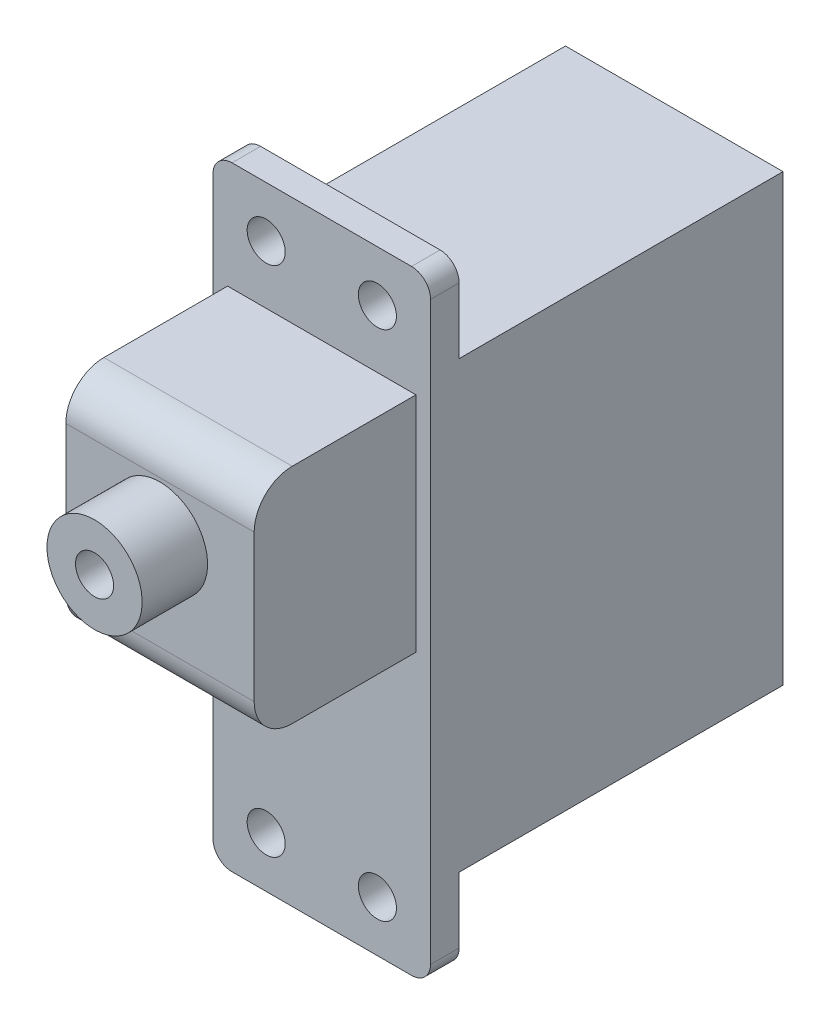
ISO-10303-21;
HEADER;
FILE_DESCRIPTION(('STEP AP214'),'2;1');
FILE_NAME('part.step','',(''),(''),'','','');
FILE_SCHEMA(('AUTOMOTIVE_DESIGN { 1 0 10303 214 1 1 1 1 }'));
ENDSEC;
DATA;
#1=APPLICATION_CONTEXT('core data for automotive mechanical design processes');
#2=APPLICATION_PROTOCOL_DEFINITION('international standard','automotive_design',2000,#1);
#3=PRODUCT_CONTEXT('',#1,'mechanical');
#4=PRODUCT('Part','Part','',(#3));
#5=PRODUCT_RELATED_PRODUCT_CATEGORY('part','',(#4));
#6=PRODUCT_DEFINITION_FORMATION('','',#4);
#7=PRODUCT_DEFINITION_CONTEXT('part definition',#1,'design');
#8=PRODUCT_DEFINITION('design','',#6,#7);
#9=PRODUCT_DEFINITION_SHAPE('','',#8);
#10=(LENGTH_UNIT() NAMED_UNIT(*) SI_UNIT(.MILLI.,.METRE.));
#11=(NAMED_UNIT(*) PLANE_ANGLE_UNIT() SI_UNIT($,.RADIAN.));
#12=(NAMED_UNIT(*) SI_UNIT($,.STERADIAN.) SOLID_ANGLE_UNIT());
#13=UNCERTAINTY_MEASURE_WITH_UNIT(LENGTH_MEASURE(1.E-05),#10,'distance_accuracy_value','');
#14=(GEOMETRIC_REPRESENTATION_CONTEXT(3) GLOBAL_UNCERTAINTY_ASSIGNED_CONTEXT((#13)) GLOBAL_UNIT_ASSIGNED_CONTEXT((#10,
#11,#12)) REPRESENTATION_CONTEXT('',''));
#15=CARTESIAN_POINT('',(0.,0.,0.));
#16=DIRECTION('',(0.,0.,1.));
#17=DIRECTION('',(1.,0.,0.));
#18=AXIS2_PLACEMENT_3D('',#15,#16,#17);
#19=CARTESIAN_POINT('',(0.,27.813,1.5));
#20=DIRECTION('',(0.,0.,1.));
#21=DIRECTION('',(1.,0.,0.));
#22=AXIS2_PLACEMENT_3D('',#19,#20,#21);
#23=PLANE('',#22);
#24=CARTESIAN_POINT('',(2.794,-1.778,1.5));
#25=DIRECTION('',(0.,0.,1.));
#26=DIRECTION('',(1.,0.,0.));
#27=AXIS2_PLACEMENT_3D('',#24,#25,#26);
#28=CIRCLE('',#27,0.999999999999986);
#29=CARTESIAN_POINT('',(3.79399999999999,-1.778,1.5));
#30=VERTEX_POINT('',#29);
#31=EDGE_CURVE('E334',#30,#30,#28,.T.);
#32=ORIENTED_EDGE('',*,*,#31,.F.);
#33=EDGE_LOOP('',(#32));
#34=FACE_BOUND('',#33,.T.);
#35=CARTESIAN_POINT('',(8.636,-1.778,1.5));
#36=DIRECTION('',(0.,0.,1.));
#37=DIRECTION('',(1.,0.,0.));
#38=AXIS2_PLACEMENT_3D('',#35,#36,#37);
#39=CIRCLE('',#38,0.999999999999986);
#40=CARTESIAN_POINT('',(9.63599999999999,-1.778,1.5));
#41=VERTEX_POINT('',#40);
#42=EDGE_CURVE('E328',#41,#41,#39,.T.);
#43=ORIENTED_EDGE('',*,*,#42,.F.);
#44=EDGE_LOOP('',(#43));
#45=FACE_BOUND('',#44,.T.);
#46=CARTESIAN_POINT('',(8.636,25.146,1.5));
#47=DIRECTION('',(0.,0.,1.));
#48=DIRECTION('',(1.,0.,0.));
#49=AXIS2_PLACEMENT_3D('',#46,#47,#48);
#50=CIRCLE('',#49,0.999999999999986);
#51=CARTESIAN_POINT('',(9.63599999999999,25.146,1.5));
#52=VERTEX_POINT('',#51);
#53=EDGE_CURVE('E322',#52,#52,#50,.T.);
#54=ORIENTED_EDGE('',*,*,#53,.F.);
#55=EDGE_LOOP('',(#54));
#56=FACE_BOUND('',#55,.T.);
#57=CARTESIAN_POINT('',(2.794,25.146,1.5));
#58=DIRECTION('',(0.,0.,1.));
#59=DIRECTION('',(1.,0.,0.));
#60=AXIS2_PLACEMENT_3D('',#57,#58,#59);
#61=CIRCLE('',#60,0.999999999999986);
#62=CARTESIAN_POINT('',(3.79399999999999,25.146,1.5));
#63=VERTEX_POINT('',#62);
#64=EDGE_CURVE('E316',#63,#63,#61,.T.);
#65=ORIENTED_EDGE('',*,*,#64,.F.);
#66=EDGE_LOOP('',(#65));
#67=FACE_BOUND('',#66,.T.);
#68=DIRECTION('',(1.,0.,0.));
#69=VECTOR('',#68,1.);
#70=CARTESIAN_POINT('',(0.,-4.445,1.5));
#71=LINE('',#70,#69);
#72=CARTESIAN_POINT('',(0.999999999999996,-4.445,1.5));
#73=VERTEX_POINT('',#72);
#74=CARTESIAN_POINT('',(10.43,-4.445,1.5));
#75=VERTEX_POINT('',#74);
#76=EDGE_CURVE('E233',#73,#75,#71,.T.);
#77=ORIENTED_EDGE('',*,*,#76,.T.);
#78=CARTESIAN_POINT('',(10.43,-3.445,1.5));
#79=DIRECTION('',(0.,0.,1.));
#80=DIRECTION('',(1.,0.,0.));
#81=AXIS2_PLACEMENT_3D('',#78,#79,#80);
#82=CIRCLE('',#81,1.);
#83=CARTESIAN_POINT('',(11.43,-3.445,1.5));
#84=VERTEX_POINT('',#83);
#85=EDGE_CURVE('E264',#75,#84,#82,.T.);
#86=ORIENTED_EDGE('',*,*,#85,.T.);
#87=DIRECTION('',(0.,-1.,0.));
#88=VECTOR('',#87,1.);
#89=CARTESIAN_POINT('',(11.43,27.813,1.5));
#90=LINE('',#89,#88);
#91=CARTESIAN_POINT('',(11.43,26.813,1.5));
#92=VERTEX_POINT('',#91);
#93=EDGE_CURVE('E220',#92,#84,#90,.T.);
#94=ORIENTED_EDGE('',*,*,#93,.F.);
#95=CARTESIAN_POINT('',(10.43,26.813,1.5));
#96=DIRECTION('',(0.,0.,1.));
#97=DIRECTION('',(1.,0.,0.));
#98=AXIS2_PLACEMENT_3D('',#95,#96,#97);
#99=CIRCLE('',#98,1.);
#100=CARTESIAN_POINT('',(10.43,27.813,1.5));
#101=VERTEX_POINT('',#100);
#102=EDGE_CURVE('E260',#92,#101,#99,.T.);
#103=ORIENTED_EDGE('',*,*,#102,.T.);
#104=DIRECTION('',(1.,0.,0.));
#105=VECTOR('',#104,1.);
#106=CARTESIAN_POINT('',(0.,27.813,1.5));
#107=LINE('',#106,#105);
#108=CARTESIAN_POINT('',(0.999999999999996,27.813,1.5));
#109=VERTEX_POINT('',#108);
#110=EDGE_CURVE('E238',#109,#101,#107,.T.);
#111=ORIENTED_EDGE('',*,*,#110,.F.);
#112=CARTESIAN_POINT('',(0.999999999999997,26.813,1.5));
#113=DIRECTION('',(0.,0.,1.));
#114=DIRECTION('',(1.,0.,0.));
#115=AXIS2_PLACEMENT_3D('',#112,#113,#114);
#116=CIRCLE('',#115,1.);
#117=CARTESIAN_POINT('',(0.,26.813,1.5));
#118=VERTEX_POINT('',#117);
#119=EDGE_CURVE('E262',#109,#118,#116,.T.);
#120=ORIENTED_EDGE('',*,*,#119,.T.);
#121=DIRECTION('',(0.,-1.,0.));
#122=VECTOR('',#121,1.);
#123=CARTESIAN_POINT('',(0.,27.813,1.5));
#124=LINE('',#123,#122);
#125=CARTESIAN_POINT('',(0.,-3.445,1.5));
#126=VERTEX_POINT('',#125);
#127=EDGE_CURVE('E226',#118,#126,#124,.T.);
#128=ORIENTED_EDGE('',*,*,#127,.T.);
#129=CARTESIAN_POINT('',(0.999999999999997,-3.445,1.5));
#130=DIRECTION('',(0.,0.,1.));
#131=DIRECTION('',(1.,0.,0.));
#132=AXIS2_PLACEMENT_3D('',#129,#130,#131);
#133=CIRCLE('',#132,1.);
#134=EDGE_CURVE('E258',#126,#73,#133,.T.);
#135=ORIENTED_EDGE('',*,*,#134,.T.);
#136=EDGE_LOOP('',(#77,#86,#94,#103,#111,#120,#128,#135));
#137=FACE_BOUND('',#136,.T.);
#138=DIRECTION('',(1.,0.,0.));
#139=VECTOR('',#138,1.);
#140=CARTESIAN_POINT('',(10.661861365,10.376691472,1.5));
#141=LINE('',#140,#139);
#142=CARTESIAN_POINT('',(0.768138635,10.376691472,1.5));
#143=VERTEX_POINT('',#142);
#144=CARTESIAN_POINT('',(10.661861365,10.376691472,1.5));
#145=VERTEX_POINT('',#144);
#146=EDGE_CURVE('E160',#143,#145,#141,.T.);
#147=ORIENTED_EDGE('',*,*,#146,.F.);
#148=DIRECTION('',(0.,-1.,0.));
#149=VECTOR('',#148,1.);
#150=CARTESIAN_POINT('',(0.768138635,10.376691472,1.5));
#151=LINE('',#150,#149);
#152=CARTESIAN_POINT('',(0.768138635,22.08777337,1.5));
#153=VERTEX_POINT('',#152);
#154=EDGE_CURVE('E167',#153,#143,#151,.T.);
#155=ORIENTED_EDGE('',*,*,#154,.F.);
#156=DIRECTION('',(-1.,0.,0.));
#157=VECTOR('',#156,1.);
#158=CARTESIAN_POINT('',(0.768138635,22.08777337,1.5));
#159=LINE('',#158,#157);
#160=CARTESIAN_POINT('',(10.661861365,22.08777337,1.5));
#161=VERTEX_POINT('',#160);
#162=EDGE_CURVE('E178',#161,#153,#159,.T.);
#163=ORIENTED_EDGE('',*,*,#162,.F.);
#164=DIRECTION('',(0.,1.,0.));
#165=VECTOR('',#164,1.);
#166=CARTESIAN_POINT('',(10.661861365,22.08777337,1.5));
#167=LINE('',#166,#165);
#168=EDGE_CURVE('E176',#145,#161,#167,.T.);
#169=ORIENTED_EDGE('',*,*,#168,.F.);
#170=EDGE_LOOP('',(#147,#155,#163,#169));
#171=FACE_BOUND('',#170,.T.);
#172=ADVANCED_FACE('F33',(#34,#45,#56,#67,#137,#171),#23,.T.);
#173=CARTESIAN_POINT('',(0.,27.813,-17.018));
#174=DIRECTION('',(0.,1.,0.));
#175=DIRECTION('',(0.,0.,1.));
#176=AXIS2_PLACEMENT_3D('',#173,#174,#175);
#177=PLANE('',#176);
#178=DIRECTION('',(-1.,0.,0.));
#179=VECTOR('',#178,1.);
#180=CARTESIAN_POINT('',(11.43,27.813,1.17600200411072E-09));
#181=LINE('',#180,#179);
#182=CARTESIAN_POINT('',(10.43,27.813,1.17600200411072E-09));
#183=VERTEX_POINT('',#182);
#184=CARTESIAN_POINT('',(0.999999999999997,27.813,1.17600200411072E-09));
#185=VERTEX_POINT('',#184);
#186=EDGE_CURVE('E201',#183,#185,#181,.T.);
#187=ORIENTED_EDGE('',*,*,#186,.T.);
#188=DIRECTION('',(0.,0.,1.));
#189=VECTOR('',#188,1.);
#190=CARTESIAN_POINT('',(0.999999999999997,27.813,1.5));
#191=LINE('',#190,#189);
#192=EDGE_CURVE('E268',#185,#109,#191,.T.);
#193=ORIENTED_EDGE('',*,*,#192,.T.);
#194=ORIENTED_EDGE('',*,*,#110,.T.);
#195=DIRECTION('',(0.,0.,1.));
#196=VECTOR('',#195,1.);
#197=CARTESIAN_POINT('',(10.43,27.813,-17.018));
#198=LINE('',#197,#196);
#199=EDGE_CURVE('E266',#101,#183,#198,.F.);
#200=ORIENTED_EDGE('',*,*,#199,.T.);
#201=EDGE_LOOP('',(#187,#193,#194,#200));
#202=FACE_BOUND('',#201,.T.);
#203=ADVANCED_FACE('F398',(#202),#177,.T.);
#204=CARTESIAN_POINT('',(0.,-4.445,-17.018));
#205=DIRECTION('',(0.,0.,-1.));
#206=DIRECTION('',(-1.,0.,0.));
#207=AXIS2_PLACEMENT_3D('',#204,#205,#206);
#208=PLANE('',#207);
#209=DIRECTION('',(-1.,0.,0.));
#210=VECTOR('',#209,1.);
#211=CARTESIAN_POINT('',(11.43,23.368000009754,-17.018));
#212=LINE('',#211,#210);
#213=CARTESIAN_POINT('',(11.43,23.368000009754,-17.018));
#214=VERTEX_POINT('',#213);
#215=CARTESIAN_POINT('',(0.,23.368000009754,-17.018));
#216=VERTEX_POINT('',#215);
#217=EDGE_CURVE('E196',#214,#216,#212,.T.);
#218=ORIENTED_EDGE('',*,*,#217,.F.);
#219=DIRECTION('',(0.,1.,0.));
#220=VECTOR('',#219,1.);
#221=CARTESIAN_POINT('',(11.43,-4.445,-17.018));
#222=LINE('',#221,#220);
#223=CARTESIAN_POINT('',(11.43,-9.7539988239137E-09,-17.018));
#224=VERTEX_POINT('',#223);
#225=EDGE_CURVE('E230',#224,#214,#222,.T.);
#226=ORIENTED_EDGE('',*,*,#225,.F.);
#227=DIRECTION('',(-1.,0.,0.));
#228=VECTOR('',#227,1.);
#229=CARTESIAN_POINT('',(11.43,-9.75399925759457E-09,-17.018));
#230=LINE('',#229,#228);
#231=CARTESIAN_POINT('',(0.,-9.75399925759457E-09,-17.018));
#232=VERTEX_POINT('',#231);
#233=EDGE_CURVE('E221',#224,#232,#230,.T.);
#234=ORIENTED_EDGE('',*,*,#233,.T.);
#235=DIRECTION('',(0.,1.,0.));
#236=VECTOR('',#235,1.);
#237=CARTESIAN_POINT('',(0.,-4.445,-17.018));
#238=LINE('',#237,#236);
#239=EDGE_CURVE('E229',#232,#216,#238,.T.);
#240=ORIENTED_EDGE('',*,*,#239,.T.);
#241=EDGE_LOOP('',(#218,#226,#234,#240));
#242=FACE_BOUND('',#241,.T.);
#243=ADVANCED_FACE('F382',(#242),#208,.T.);
#244=CARTESIAN_POINT('',(0.,-4.445,1.5));
#245=DIRECTION('',(0.,-1.,0.));
#246=DIRECTION('',(0.,0.,-1.));
#247=AXIS2_PLACEMENT_3D('',#244,#245,#246);
#248=PLANE('',#247);
#249=DIRECTION('',(-1.,0.,0.));
#250=VECTOR('',#249,1.);
#251=CARTESIAN_POINT('',(11.43,-4.445,1.1760037388342E-09));
#252=LINE('',#251,#250);
#253=CARTESIAN_POINT('',(10.43,-4.445,1.1760037388342E-09));
#254=VERTEX_POINT('',#253);
#255=CARTESIAN_POINT('',(0.999999999999997,-4.445,1.1760037388342E-09));
#256=VERTEX_POINT('',#255);
#257=EDGE_CURVE('E217',#254,#256,#252,.T.);
#258=ORIENTED_EDGE('',*,*,#257,.F.);
#259=DIRECTION('',(0.,0.,-1.));
#260=VECTOR('',#259,1.);
#261=CARTESIAN_POINT('',(10.43,-4.445,1.5));
#262=LINE('',#261,#260);
#263=EDGE_CURVE('E256',#254,#75,#262,.F.);
#264=ORIENTED_EDGE('',*,*,#263,.T.);
#265=ORIENTED_EDGE('',*,*,#76,.F.);
#266=DIRECTION('',(0.,0.,-1.));
#267=VECTOR('',#266,1.);
#268=CARTESIAN_POINT('',(0.999999999999997,-4.445,1.1760037388342E-09));
#269=LINE('',#268,#267);
#270=EDGE_CURVE('E253',#73,#256,#269,.T.);
#271=ORIENTED_EDGE('',*,*,#270,.T.);
#272=EDGE_LOOP('',(#258,#264,#265,#271));
#273=FACE_BOUND('',#272,.T.);
#274=ADVANCED_FACE('F365',(#273),#248,.T.);
#275=CARTESIAN_POINT('',(0.,-4.445,1.5));
#276=DIRECTION('',(1.,0.,0.));
#277=DIRECTION('',(0.,0.,-1.));
#278=AXIS2_PLACEMENT_3D('',#275,#276,#277);
#279=PLANE('',#278);
#280=ORIENTED_EDGE('',*,*,#127,.F.);
#281=DIRECTION('',(0.,0.,1.));
#282=VECTOR('',#281,1.);
#283=CARTESIAN_POINT('',(0.,26.813,1.17600026938725E-09));
#284=LINE('',#283,#282);
#285=CARTESIAN_POINT('',(0.,26.813,1.17600200411072E-09));
#286=VERTEX_POINT('',#285);
#287=EDGE_CURVE('E273',#118,#286,#284,.F.);
#288=ORIENTED_EDGE('',*,*,#287,.T.);
#289=DIRECTION('',(0.,1.,0.));
#290=VECTOR('',#289,1.);
#291=CARTESIAN_POINT('',(0.,23.368000009754,1.17600200411072E-09));
#292=LINE('',#291,#290);
#293=CARTESIAN_POINT('',(0.,23.368000009754,1.17600200411072E-09));
#294=VERTEX_POINT('',#293);
#295=EDGE_CURVE('E193',#294,#286,#292,.T.);
#296=ORIENTED_EDGE('',*,*,#295,.F.);
#297=DIRECTION('',(0.,0.,1.));
#298=VECTOR('',#297,1.);
#299=CARTESIAN_POINT('',(0.,23.368000009754,-17.018));
#300=LINE('',#299,#298);
#301=EDGE_CURVE('E163',#216,#294,#300,.T.);
#302=ORIENTED_EDGE('',*,*,#301,.F.);
#303=ORIENTED_EDGE('',*,*,#239,.F.);
#304=DIRECTION('',(0.,0.,-1.));
#305=VECTOR('',#304,1.);
#306=CARTESIAN_POINT('',(0.,-9.75399925759457E-09,1.17600200411072E-09));
#307=LINE('',#306,#305);
#308=CARTESIAN_POINT('',(0.,-9.75399925759457E-09,1.17600200411072E-09));
#309=VERTEX_POINT('',#308);
#310=EDGE_CURVE('E211',#309,#232,#307,.T.);
#311=ORIENTED_EDGE('',*,*,#310,.F.);
#312=DIRECTION('',(0.,1.,0.));
#313=VECTOR('',#312,1.);
#314=CARTESIAN_POINT('',(0.,-4.445,1.1760037388342E-09));
#315=LINE('',#314,#313);
#316=CARTESIAN_POINT('',(0.,-3.445,1.1760033485702E-09));
#317=VERTEX_POINT('',#316);
#318=EDGE_CURVE('E204',#317,#309,#315,.T.);
#319=ORIENTED_EDGE('',*,*,#318,.F.);
#320=DIRECTION('',(0.,0.,-1.));
#321=VECTOR('',#320,1.);
#322=CARTESIAN_POINT('',(0.,-3.445,1.5));
#323=LINE('',#322,#321);
#324=EDGE_CURVE('E271',#317,#126,#323,.F.);
#325=ORIENTED_EDGE('',*,*,#324,.T.);
#326=EDGE_LOOP('',(#280,#288,#296,#302,#303,#311,#319,#325));
#327=FACE_BOUND('',#326,.T.);
#328=ADVANCED_FACE('F376',(#327),#279,.F.);
#329=CARTESIAN_POINT('',(11.43,-4.445,1.5));
#330=DIRECTION('',(1.,0.,0.));
#331=DIRECTION('',(0.,0.,-1.));
#332=AXIS2_PLACEMENT_3D('',#329,#330,#331);
#333=PLANE('',#332);
#334=ORIENTED_EDGE('',*,*,#93,.T.);
#335=DIRECTION('',(0.,0.,-1.));
#336=VECTOR('',#335,1.);
#337=CARTESIAN_POINT('',(11.43,-3.445,1.5));
#338=LINE('',#337,#336);
#339=CARTESIAN_POINT('',(11.43,-3.445,1.1760033485702E-09));
#340=VERTEX_POINT('',#339);
#341=EDGE_CURVE('E246',#84,#340,#338,.T.);
#342=ORIENTED_EDGE('',*,*,#341,.T.);
#343=DIRECTION('',(0.,1.,0.));
#344=VECTOR('',#343,1.);
#345=CARTESIAN_POINT('',(11.43,-4.445,1.1760037388342E-09));
#346=LINE('',#345,#344);
#347=CARTESIAN_POINT('',(11.43,-9.75399925759457E-09,1.17600200411072E-09));
#348=VERTEX_POINT('',#347);
#349=EDGE_CURVE('E208',#340,#348,#346,.T.);
#350=ORIENTED_EDGE('',*,*,#349,.T.);
#351=DIRECTION('',(0.,0.,-1.));
#352=VECTOR('',#351,1.);
#353=CARTESIAN_POINT('',(11.43,-9.75399925759457E-09,1.17600200411072E-09));
#354=LINE('',#353,#352);
#355=EDGE_CURVE('E210',#348,#224,#354,.T.);
#356=ORIENTED_EDGE('',*,*,#355,.T.);
#357=ORIENTED_EDGE('',*,*,#225,.T.);
#358=DIRECTION('',(0.,0.,1.));
#359=VECTOR('',#358,1.);
#360=CARTESIAN_POINT('',(11.43,23.368000009754,-17.018));
#361=LINE('',#360,#359);
#362=CARTESIAN_POINT('',(11.43,23.368000009754,1.17600200411072E-09));
#363=VERTEX_POINT('',#362);
#364=EDGE_CURVE('E189',#214,#363,#361,.T.);
#365=ORIENTED_EDGE('',*,*,#364,.T.);
#366=DIRECTION('',(0.,1.,0.));
#367=VECTOR('',#366,1.);
#368=CARTESIAN_POINT('',(11.43,23.368000009754,1.17600200411072E-09));
#369=LINE('',#368,#367);
#370=CARTESIAN_POINT('',(11.43,26.813,1.17600200411072E-09));
#371=VERTEX_POINT('',#370);
#372=EDGE_CURVE('E192',#363,#371,#369,.T.);
#373=ORIENTED_EDGE('',*,*,#372,.T.);
#374=DIRECTION('',(0.,0.,1.));
#375=VECTOR('',#374,1.);
#376=CARTESIAN_POINT('',(11.43,26.813,1.50000000000001));
#377=LINE('',#376,#375);
#378=EDGE_CURVE('E241',#371,#92,#377,.T.);
#379=ORIENTED_EDGE('',*,*,#378,.T.);
#380=EDGE_LOOP('',(#334,#342,#350,#356,#357,#365,#373,#379));
#381=FACE_BOUND('',#380,.T.);
#382=ADVANCED_FACE('F347',(#381),#333,.T.);
#383=CARTESIAN_POINT('',(11.43,-4.445,1.1760037388342E-09));
#384=DIRECTION('',(0.,0.,1.));
#385=DIRECTION('',(0.,-1.,0.));
#386=AXIS2_PLACEMENT_3D('',#383,#384,#385);
#387=PLANE('',#386);
#388=CARTESIAN_POINT('',(2.794,-1.778,0.));
#389=DIRECTION('',(0.,0.,-1.));
#390=DIRECTION('',(0.,1.,0.));
#391=AXIS2_PLACEMENT_3D('',#388,#389,#390);
#392=CIRCLE('',#391,0.999999999999987);
#393=CARTESIAN_POINT('',(2.794,-0.778000000000013,0.));
#394=VERTEX_POINT('',#393);
#395=EDGE_CURVE('E337',#394,#394,#392,.T.);
#396=ORIENTED_EDGE('',*,*,#395,.F.);
#397=EDGE_LOOP('',(#396));
#398=FACE_BOUND('',#397,.T.);
#399=CARTESIAN_POINT('',(8.636,-1.778,0.));
#400=DIRECTION('',(0.,0.,-1.));
#401=DIRECTION('',(0.,1.,0.));
#402=AXIS2_PLACEMENT_3D('',#399,#400,#401);
#403=CIRCLE('',#402,0.999999999999987);
#404=CARTESIAN_POINT('',(8.636,-0.778000000000013,0.));
#405=VERTEX_POINT('',#404);
#406=EDGE_CURVE('E331',#405,#405,#403,.T.);
#407=ORIENTED_EDGE('',*,*,#406,.F.);
#408=EDGE_LOOP('',(#407));
#409=FACE_BOUND('',#408,.T.);
#410=ORIENTED_EDGE('',*,*,#349,.F.);
#411=CARTESIAN_POINT('',(10.43,-3.445,1.17600330515333E-09));
#412=DIRECTION('',(0.,0.,1.));
#413=DIRECTION('',(0.,-1.,0.));
#414=AXIS2_PLACEMENT_3D('',#411,#412,#413);
#415=CIRCLE('',#414,1.);
#416=EDGE_CURVE('E251',#340,#254,#415,.F.);
#417=ORIENTED_EDGE('',*,*,#416,.T.);
#418=ORIENTED_EDGE('',*,*,#257,.T.);
#419=CARTESIAN_POINT('',(0.999999999999997,-3.445,1.17600330515333E-09));
#420=DIRECTION('',(0.,0.,1.));
#421=DIRECTION('',(0.,-1.,0.));
#422=AXIS2_PLACEMENT_3D('',#419,#420,#421);
#423=CIRCLE('',#422,1.);
#424=EDGE_CURVE('E249',#256,#317,#423,.F.);
#425=ORIENTED_EDGE('',*,*,#424,.T.);
#426=ORIENTED_EDGE('',*,*,#318,.T.);
#427=DIRECTION('',(-1.,0.,0.));
#428=VECTOR('',#427,1.);
#429=CARTESIAN_POINT('',(11.43,-9.75399925759457E-09,1.17600200411072E-09));
#430=LINE('',#429,#428);
#431=EDGE_CURVE('E214',#348,#309,#430,.T.);
#432=ORIENTED_EDGE('',*,*,#431,.F.);
#433=EDGE_LOOP('',(#410,#417,#418,#425,#426,#432));
#434=FACE_BOUND('',#433,.T.);
#435=ADVANCED_FACE('F343',(#398,#409,#434),#387,.F.);
#436=CARTESIAN_POINT('',(11.43,-9.75399925759457E-09,1.17600200411072E-09));
#437=DIRECTION('',(0.,1.,0.));
#438=DIRECTION('',(0.,0.,1.));
#439=AXIS2_PLACEMENT_3D('',#436,#437,#438);
#440=PLANE('',#439);
#441=ORIENTED_EDGE('',*,*,#310,.T.);
#442=ORIENTED_EDGE('',*,*,#233,.F.);
#443=ORIENTED_EDGE('',*,*,#355,.F.);
#444=ORIENTED_EDGE('',*,*,#431,.T.);
#445=EDGE_LOOP('',(#441,#442,#443,#444));
#446=FACE_BOUND('',#445,.T.);
#447=ADVANCED_FACE('F346',(#446),#440,.F.);
#448=CARTESIAN_POINT('',(11.43,23.368000009754,1.17600200411072E-09));
#449=DIRECTION('',(0.,0.,1.));
#450=DIRECTION('',(1.,0.,0.));
#451=AXIS2_PLACEMENT_3D('',#448,#449,#450);
#452=PLANE('',#451);
#453=CARTESIAN_POINT('',(8.636,25.146,0.));
#454=DIRECTION('',(0.,0.,-1.));
#455=DIRECTION('',(0.,1.,0.));
#456=AXIS2_PLACEMENT_3D('',#453,#454,#455);
#457=CIRCLE('',#456,0.999999999999987);
#458=CARTESIAN_POINT('',(8.636,26.146,0.));
#459=VERTEX_POINT('',#458);
#460=EDGE_CURVE('E325',#459,#459,#457,.T.);
#461=ORIENTED_EDGE('',*,*,#460,.F.);
#462=EDGE_LOOP('',(#461));
#463=FACE_BOUND('',#462,.T.);
#464=CARTESIAN_POINT('',(2.794,25.146,0.));
#465=DIRECTION('',(0.,0.,-1.));
#466=DIRECTION('',(0.,1.,0.));
#467=AXIS2_PLACEMENT_3D('',#464,#465,#466);
#468=CIRCLE('',#467,0.999999999999987);
#469=CARTESIAN_POINT('',(2.794,26.146,0.));
#470=VERTEX_POINT('',#469);
#471=EDGE_CURVE('E319',#470,#470,#468,.T.);
#472=ORIENTED_EDGE('',*,*,#471,.F.);
#473=EDGE_LOOP('',(#472));
#474=FACE_BOUND('',#473,.T.);
#475=ORIENTED_EDGE('',*,*,#295,.T.);
#476=CARTESIAN_POINT('',(0.999999999999997,26.813,1.17600026938725E-09));
#477=DIRECTION('',(0.,0.,1.));
#478=DIRECTION('',(1.,0.,0.));
#479=AXIS2_PLACEMENT_3D('',#476,#477,#478);
#480=CIRCLE('',#479,1.);
#481=EDGE_CURVE('E277',#286,#185,#480,.F.);
#482=ORIENTED_EDGE('',*,*,#481,.T.);
#483=ORIENTED_EDGE('',*,*,#186,.F.);
#484=CARTESIAN_POINT('',(10.43,26.813,1.17600200411072E-09));
#485=DIRECTION('',(0.,0.,1.));
#486=DIRECTION('',(1.,0.,0.));
#487=AXIS2_PLACEMENT_3D('',#484,#485,#486);
#488=CIRCLE('',#487,1.);
#489=EDGE_CURVE('E275',#183,#371,#488,.F.);
#490=ORIENTED_EDGE('',*,*,#489,.T.);
#491=ORIENTED_EDGE('',*,*,#372,.F.);
#492=DIRECTION('',(-1.,0.,0.));
#493=VECTOR('',#492,1.);
#494=CARTESIAN_POINT('',(11.43,23.368000009754,1.17600200411072E-09));
#495=LINE('',#494,#493);
#496=EDGE_CURVE('E205',#363,#294,#495,.T.);
#497=ORIENTED_EDGE('',*,*,#496,.T.);
#498=EDGE_LOOP('',(#475,#482,#483,#490,#491,#497));
#499=FACE_BOUND('',#498,.T.);
#500=ADVANCED_FACE('F389',(#463,#474,#499),#452,.F.);
#501=CARTESIAN_POINT('',(11.43,23.368000009754,-17.018));
#502=DIRECTION('',(0.,-1.,0.));
#503=DIRECTION('',(0.,0.,-1.));
#504=AXIS2_PLACEMENT_3D('',#501,#502,#503);
#505=PLANE('',#504);
#506=ORIENTED_EDGE('',*,*,#301,.T.);
#507=ORIENTED_EDGE('',*,*,#496,.F.);
#508=ORIENTED_EDGE('',*,*,#364,.F.);
#509=ORIENTED_EDGE('',*,*,#217,.T.);
#510=EDGE_LOOP('',(#506,#507,#508,#509));
#511=FACE_BOUND('',#510,.T.);
#512=ADVANCED_FACE('F386',(#511),#505,.F.);
#513=CARTESIAN_POINT('',(0.768138635,10.376691472,10.));
#514=DIRECTION('',(1.,0.,0.));
#515=DIRECTION('',(0.,0.,-1.));
#516=AXIS2_PLACEMENT_3D('',#513,#514,#515);
#517=PLANE('',#516);
#518=DIRECTION('',(0.,0.,-1.));
#519=VECTOR('',#518,1.);
#520=CARTESIAN_POINT('',(0.768138635,10.376691472,10.));
#521=LINE('',#520,#519);
#522=CARTESIAN_POINT('',(0.768138635,10.376691472,8.));
#523=VERTEX_POINT('',#522);
#524=EDGE_CURVE('E156',#523,#143,#521,.T.);
#525=ORIENTED_EDGE('',*,*,#524,.F.);
#526=CARTESIAN_POINT('',(0.768138635,12.376691472,8.));
#527=DIRECTION('',(1.,0.,0.));
#528=DIRECTION('',(0.,0.,-1.));
#529=AXIS2_PLACEMENT_3D('',#526,#527,#528);
#530=CIRCLE('',#529,2.);
#531=CARTESIAN_POINT('',(0.768138635,12.376691472,10.));
#532=VERTEX_POINT('',#531);
#533=EDGE_CURVE('E41',#523,#532,#530,.F.);
#534=ORIENTED_EDGE('',*,*,#533,.T.);
#535=DIRECTION('',(0.,-1.,0.));
#536=VECTOR('',#535,1.);
#537=CARTESIAN_POINT('',(0.768138635,10.376691472,10.));
#538=LINE('',#537,#536);
#539=CARTESIAN_POINT('',(0.768138635,20.08777337,10.));
#540=VERTEX_POINT('',#539);
#541=EDGE_CURVE('E183',#540,#532,#538,.T.);
#542=ORIENTED_EDGE('',*,*,#541,.F.);
#543=CARTESIAN_POINT('',(0.768138635,20.08777337,8.));
#544=DIRECTION('',(1.,0.,0.));
#545=DIRECTION('',(0.,0.,-1.));
#546=AXIS2_PLACEMENT_3D('',#543,#544,#545);
#547=CIRCLE('',#546,2.);
#548=CARTESIAN_POINT('',(0.768138635,22.08777337,8.));
#549=VERTEX_POINT('',#548);
#550=EDGE_CURVE('E48',#540,#549,#547,.F.);
#551=ORIENTED_EDGE('',*,*,#550,.T.);
#552=DIRECTION('',(0.,0.,-1.));
#553=VECTOR('',#552,1.);
#554=CARTESIAN_POINT('',(0.768138635,22.08777337,10.));
#555=LINE('',#554,#553);
#556=EDGE_CURVE('E169',#549,#153,#555,.T.);
#557=ORIENTED_EDGE('',*,*,#556,.T.);
#558=ORIENTED_EDGE('',*,*,#154,.T.);
#559=EDGE_LOOP('',(#525,#534,#542,#551,#557,#558));
#560=FACE_BOUND('',#559,.T.);
#561=ADVANCED_FACE('F168',(#560),#517,.F.);
#562=CARTESIAN_POINT('',(10.661861365,10.376691472,10.));
#563=DIRECTION('',(0.,1.,0.));
#564=DIRECTION('',(-1.,0.,0.));
#565=AXIS2_PLACEMENT_3D('',#562,#563,#564);
#566=PLANE('',#565);
#567=DIRECTION('',(0.,0.,-1.));
#568=VECTOR('',#567,1.);
#569=CARTESIAN_POINT('',(10.661861365,10.376691472,10.));
#570=LINE('',#569,#568);
#571=CARTESIAN_POINT('',(10.661861365,10.376691472,8.));
#572=VERTEX_POINT('',#571);
#573=EDGE_CURVE('E164',#572,#145,#570,.T.);
#574=ORIENTED_EDGE('',*,*,#573,.F.);
#575=DIRECTION('',(1.,0.,0.));
#576=VECTOR('',#575,1.);
#577=CARTESIAN_POINT('',(10.661861365,10.376691472,8.));
#578=LINE('',#577,#576);
#579=EDGE_CURVE('E56',#572,#523,#578,.F.);
#580=ORIENTED_EDGE('',*,*,#579,.T.);
#581=ORIENTED_EDGE('',*,*,#524,.T.);
#582=ORIENTED_EDGE('',*,*,#146,.T.);
#583=EDGE_LOOP('',(#574,#580,#581,#582));
#584=FACE_BOUND('',#583,.T.);
#585=ADVANCED_FACE('F158',(#584),#566,.F.);
#586=CARTESIAN_POINT('',(10.661861365,22.08777337,10.));
#587=DIRECTION('',(-1.,0.,0.));
#588=DIRECTION('',(0.,0.,1.));
#589=AXIS2_PLACEMENT_3D('',#586,#587,#588);
#590=PLANE('',#589);
#591=DIRECTION('',(0.,1.,0.));
#592=VECTOR('',#591,1.);
#593=CARTESIAN_POINT('',(10.661861365,22.08777337,10.));
#594=LINE('',#593,#592);
#595=CARTESIAN_POINT('',(10.661861365,12.376691472,10.));
#596=VERTEX_POINT('',#595);
#597=CARTESIAN_POINT('',(10.661861365,20.08777337,10.));
#598=VERTEX_POINT('',#597);
#599=EDGE_CURVE('E186',#596,#598,#594,.T.);
#600=ORIENTED_EDGE('',*,*,#599,.F.);
#601=CARTESIAN_POINT('',(10.661861365,12.376691472,8.));
#602=DIRECTION('',(-1.,0.,0.));
#603=DIRECTION('',(0.,0.,1.));
#604=AXIS2_PLACEMENT_3D('',#601,#602,#603);
#605=CIRCLE('',#604,2.);
#606=EDGE_CURVE('E287',#596,#572,#605,.F.);
#607=ORIENTED_EDGE('',*,*,#606,.T.);
#608=ORIENTED_EDGE('',*,*,#573,.T.);
#609=ORIENTED_EDGE('',*,*,#168,.T.);
#610=DIRECTION('',(0.,0.,-1.));
#611=VECTOR('',#610,1.);
#612=CARTESIAN_POINT('',(10.661861365,22.08777337,10.));
#613=LINE('',#612,#611);
#614=CARTESIAN_POINT('',(10.661861365,22.08777337,8.));
#615=VERTEX_POINT('',#614);
#616=EDGE_CURVE('E185',#615,#161,#613,.T.);
#617=ORIENTED_EDGE('',*,*,#616,.F.);
#618=CARTESIAN_POINT('',(10.661861365,20.08777337,8.));
#619=DIRECTION('',(-1.,0.,0.));
#620=DIRECTION('',(0.,0.,1.));
#621=AXIS2_PLACEMENT_3D('',#618,#619,#620);
#622=CIRCLE('',#621,2.);
#623=EDGE_CURVE('E285',#615,#598,#622,.F.);
#624=ORIENTED_EDGE('',*,*,#623,.T.);
#625=EDGE_LOOP('',(#600,#607,#608,#609,#617,#624));
#626=FACE_BOUND('',#625,.T.);
#627=ADVANCED_FACE('F301',(#626),#590,.F.);
#628=CARTESIAN_POINT('',(0.768138635,22.08777337,10.));
#629=DIRECTION('',(0.,-1.,0.));
#630=DIRECTION('',(0.,0.,-1.));
#631=AXIS2_PLACEMENT_3D('',#628,#629,#630);
#632=PLANE('',#631);
#633=ORIENTED_EDGE('',*,*,#556,.F.);
#634=DIRECTION('',(-1.,0.,0.));
#635=VECTOR('',#634,1.);
#636=CARTESIAN_POINT('',(0.768138635,22.08777337,8.));
#637=LINE('',#636,#635);
#638=EDGE_CURVE('E11',#549,#615,#637,.F.);
#639=ORIENTED_EDGE('',*,*,#638,.T.);
#640=ORIENTED_EDGE('',*,*,#616,.T.);
#641=ORIENTED_EDGE('',*,*,#162,.T.);
#642=EDGE_LOOP('',(#633,#639,#640,#641));
#643=FACE_BOUND('',#642,.T.);
#644=ADVANCED_FACE('F442',(#643),#632,.F.);
#645=CARTESIAN_POINT('',(0.768138635,22.08777337,10.));
#646=DIRECTION('',(0.,0.,-1.));
#647=DIRECTION('',(-1.,0.,0.));
#648=AXIS2_PLACEMENT_3D('',#645,#646,#647);
#649=PLANE('',#648);
#650=CARTESIAN_POINT('',(5.715,17.399,10.));
#651=DIRECTION('',(0.,0.,-1.));
#652=DIRECTION('',(-1.,0.,0.));
#653=AXIS2_PLACEMENT_3D('',#650,#651,#652);
#654=CIRCLE('',#653,2.5);
#655=CARTESIAN_POINT('',(3.215,17.399,10.));
#656=VERTEX_POINT('',#655);
#657=EDGE_CURVE('E307',#656,#656,#654,.T.);
#658=ORIENTED_EDGE('',*,*,#657,.T.);
#659=EDGE_LOOP('',(#658));
#660=FACE_BOUND('',#659,.T.);
#661=ORIENTED_EDGE('',*,*,#541,.T.);
#662=DIRECTION('',(1.,0.,0.));
#663=VECTOR('',#662,1.);
#664=CARTESIAN_POINT('',(0.768138635000002,12.376691472,10.));
#665=LINE('',#664,#663);
#666=EDGE_CURVE('E282',#532,#596,#665,.T.);
#667=ORIENTED_EDGE('',*,*,#666,.T.);
#668=ORIENTED_EDGE('',*,*,#599,.T.);
#669=DIRECTION('',(-1.,0.,0.));
#670=VECTOR('',#669,1.);
#671=CARTESIAN_POINT('',(0.768138635,20.08777337,10.));
#672=LINE('',#671,#670);
#673=EDGE_CURVE('E279',#598,#540,#672,.T.);
#674=ORIENTED_EDGE('',*,*,#673,.T.);
#675=EDGE_LOOP('',(#661,#667,#668,#674));
#676=FACE_BOUND('',#675,.T.);
#677=ADVANCED_FACE('F294',(#660,#676),#649,.F.);
#678=CARTESIAN_POINT('',(5.715,17.399,13.438));
#679=DIRECTION('',(0.,0.,-1.));
#680=DIRECTION('',(-1.,0.,0.));
#681=AXIS2_PLACEMENT_3D('',#678,#679,#680);
#682=CYLINDRICAL_SURFACE('',#681,2.5);
#683=CARTESIAN_POINT('',(5.715,17.399,13.438));
#684=DIRECTION('',(0.,0.,-1.));
#685=DIRECTION('',(-1.,0.,0.));
#686=AXIS2_PLACEMENT_3D('',#683,#684,#685);
#687=CIRCLE('',#686,2.5);
#688=CARTESIAN_POINT('',(3.215,17.399,13.438));
#689=VERTEX_POINT('',#688);
#690=EDGE_CURVE('E173',#689,#689,#687,.T.);
#691=ORIENTED_EDGE('',*,*,#690,.T.);
#692=EDGE_LOOP('',(#691));
#693=FACE_BOUND('',#692,.T.);
#694=ORIENTED_EDGE('',*,*,#657,.F.);
#695=EDGE_LOOP('',(#694));
#696=FACE_BOUND('',#695,.T.);
#697=ADVANCED_FACE('F448',(#693,#696),#682,.T.);
#698=CARTESIAN_POINT('',(8.215,17.399,13.438));
#699=DIRECTION('',(0.,0.,1.));
#700=DIRECTION('',(1.,0.,0.));
#701=AXIS2_PLACEMENT_3D('',#698,#699,#700);
#702=PLANE('',#701);
#703=CARTESIAN_POINT('',(5.715,17.399,13.438));
#704=DIRECTION('',(0.,0.,1.));
#705=DIRECTION('',(1.,0.,0.));
#706=AXIS2_PLACEMENT_3D('',#703,#704,#705);
#707=CIRCLE('',#706,0.999999999999989);
#708=CARTESIAN_POINT('',(6.71499999999999,17.399,13.438));
#709=VERTEX_POINT('',#708);
#710=EDGE_CURVE('E313',#709,#709,#707,.T.);
#711=ORIENTED_EDGE('',*,*,#710,.F.);
#712=EDGE_LOOP('',(#711));
#713=FACE_BOUND('',#712,.T.);
#714=ORIENTED_EDGE('',*,*,#690,.F.);
#715=EDGE_LOOP('',(#714));
#716=FACE_BOUND('',#715,.T.);
#717=ADVANCED_FACE('F452',(#713,#716),#702,.T.);
#718=CARTESIAN_POINT('',(5.715,17.399,11.438));
#719=DIRECTION('',(0.,0.,-1.));
#720=DIRECTION('',(-1.,0.,0.));
#721=AXIS2_PLACEMENT_3D('',#718,#719,#720);
#722=PLANE('',#721);
#723=CARTESIAN_POINT('',(5.715,17.399,11.438));
#724=DIRECTION('',(0.,0.,1.));
#725=DIRECTION('',(1.,0.,0.));
#726=AXIS2_PLACEMENT_3D('',#723,#724,#725);
#727=CIRCLE('',#726,0.999999999999987);
#728=CARTESIAN_POINT('',(6.71499999999999,17.399,11.438));
#729=VERTEX_POINT('',#728);
#730=EDGE_CURVE('E310',#729,#729,#727,.T.);
#731=ORIENTED_EDGE('',*,*,#730,.T.);
#732=EDGE_LOOP('',(#731));
#733=FACE_BOUND('',#732,.T.);
#734=ADVANCED_FACE('F456',(#733),#722,.F.);
#735=CARTESIAN_POINT('',(5.715,17.399,13.438));
#736=DIRECTION('',(0.,0.,1.));
#737=DIRECTION('',(1.,0.,0.));
#738=AXIS2_PLACEMENT_3D('',#735,#736,#737);
#739=CYLINDRICAL_SURFACE('',#738,0.999999999999988);
#740=ORIENTED_EDGE('',*,*,#730,.F.);
#741=EDGE_LOOP('',(#740));
#742=FACE_BOUND('',#741,.T.);
#743=ORIENTED_EDGE('',*,*,#710,.T.);
#744=EDGE_LOOP('',(#743));
#745=FACE_BOUND('',#744,.T.);
#746=ADVANCED_FACE('F460',(#742,#745),#739,.F.);
#747=CARTESIAN_POINT('',(2.794,25.146,0.));
#748=DIRECTION('',(0.,0.,-1.));
#749=DIRECTION('',(0.,1.,0.));
#750=AXIS2_PLACEMENT_3D('',#747,#748,#749);
#751=CYLINDRICAL_SURFACE('',#750,0.999999999999986);
#752=ORIENTED_EDGE('',*,*,#64,.T.);
#753=EDGE_LOOP('',(#752));
#754=FACE_BOUND('',#753,.T.);
#755=ORIENTED_EDGE('',*,*,#471,.T.);
#756=EDGE_LOOP('',(#755));
#757=FACE_BOUND('',#756,.T.);
#758=ADVANCED_FACE('F464',(#754,#757),#751,.F.);
#759=CARTESIAN_POINT('',(8.636,25.146,0.));
#760=DIRECTION('',(0.,0.,-1.));
#761=DIRECTION('',(0.,1.,0.));
#762=AXIS2_PLACEMENT_3D('',#759,#760,#761);
#763=CYLINDRICAL_SURFACE('',#762,0.999999999999986);
#764=ORIENTED_EDGE('',*,*,#53,.T.);
#765=EDGE_LOOP('',(#764));
#766=FACE_BOUND('',#765,.T.);
#767=ORIENTED_EDGE('',*,*,#460,.T.);
#768=EDGE_LOOP('',(#767));
#769=FACE_BOUND('',#768,.T.);
#770=ADVANCED_FACE('F468',(#766,#769),#763,.F.);
#771=CARTESIAN_POINT('',(8.636,-1.778,0.));
#772=DIRECTION('',(0.,0.,-1.));
#773=DIRECTION('',(0.,1.,0.));
#774=AXIS2_PLACEMENT_3D('',#771,#772,#773);
#775=CYLINDRICAL_SURFACE('',#774,0.999999999999986);
#776=ORIENTED_EDGE('',*,*,#42,.T.);
#777=EDGE_LOOP('',(#776));
#778=FACE_BOUND('',#777,.T.);
#779=ORIENTED_EDGE('',*,*,#406,.T.);
#780=EDGE_LOOP('',(#779));
#781=FACE_BOUND('',#780,.T.);
#782=ADVANCED_FACE('F472',(#778,#781),#775,.F.);
#783=CARTESIAN_POINT('',(2.794,-1.778,0.));
#784=DIRECTION('',(0.,0.,-1.));
#785=DIRECTION('',(0.,1.,0.));
#786=AXIS2_PLACEMENT_3D('',#783,#784,#785);
#787=CYLINDRICAL_SURFACE('',#786,0.999999999999986);
#788=ORIENTED_EDGE('',*,*,#31,.T.);
#789=EDGE_LOOP('',(#788));
#790=FACE_BOUND('',#789,.T.);
#791=ORIENTED_EDGE('',*,*,#395,.T.);
#792=EDGE_LOOP('',(#791));
#793=FACE_BOUND('',#792,.T.);
#794=ADVANCED_FACE('F341',(#790,#793),#787,.F.);
#795=CARTESIAN_POINT('',(10.43,-3.445,1.5));
#796=DIRECTION('',(0.,0.,-1.));
#797=DIRECTION('',(-1.,0.,0.));
#798=AXIS2_PLACEMENT_3D('',#795,#796,#797);
#799=CYLINDRICAL_SURFACE('',#798,1.);
#800=ORIENTED_EDGE('',*,*,#85,.F.);
#801=ORIENTED_EDGE('',*,*,#263,.F.);
#802=ORIENTED_EDGE('',*,*,#416,.F.);
#803=ORIENTED_EDGE('',*,*,#341,.F.);
#804=EDGE_LOOP('',(#800,#801,#802,#803));
#805=FACE_BOUND('',#804,.T.);
#806=ADVANCED_FACE('F361',(#805),#799,.T.);
#807=CARTESIAN_POINT('',(0.999999999999997,26.813,-17.018));
#808=DIRECTION('',(0.,0.,-1.));
#809=DIRECTION('',(0.,1.,0.));
#810=AXIS2_PLACEMENT_3D('',#807,#808,#809);
#811=CYLINDRICAL_SURFACE('',#810,1.);
#812=ORIENTED_EDGE('',*,*,#481,.F.);
#813=ORIENTED_EDGE('',*,*,#287,.F.);
#814=ORIENTED_EDGE('',*,*,#119,.F.);
#815=ORIENTED_EDGE('',*,*,#192,.F.);
#816=EDGE_LOOP('',(#812,#813,#814,#815));
#817=FACE_BOUND('',#816,.T.);
#818=ADVANCED_FACE('F401',(#817),#811,.T.);
#819=CARTESIAN_POINT('',(10.43,26.813,1.50000000000001));
#820=DIRECTION('',(0.,0.,1.));
#821=DIRECTION('',(0.,-1.,0.));
#822=AXIS2_PLACEMENT_3D('',#819,#820,#821);
#823=CYLINDRICAL_SURFACE('',#822,1.);
#824=ORIENTED_EDGE('',*,*,#489,.F.);
#825=ORIENTED_EDGE('',*,*,#199,.F.);
#826=ORIENTED_EDGE('',*,*,#102,.F.);
#827=ORIENTED_EDGE('',*,*,#378,.F.);
#828=EDGE_LOOP('',(#824,#825,#826,#827));
#829=FACE_BOUND('',#828,.T.);
#830=ADVANCED_FACE('F395',(#829),#823,.T.);
#831=CARTESIAN_POINT('',(0.999999999999997,-3.445,1.5));
#832=DIRECTION('',(0.,0.,1.));
#833=DIRECTION('',(1.,0.,0.));
#834=AXIS2_PLACEMENT_3D('',#831,#832,#833);
#835=CYLINDRICAL_SURFACE('',#834,1.);
#836=ORIENTED_EDGE('',*,*,#134,.F.);
#837=ORIENTED_EDGE('',*,*,#324,.F.);
#838=ORIENTED_EDGE('',*,*,#424,.F.);
#839=ORIENTED_EDGE('',*,*,#270,.F.);
#840=EDGE_LOOP('',(#836,#837,#838,#839));
#841=FACE_BOUND('',#840,.T.);
#842=ADVANCED_FACE('F372',(#841),#835,.T.);
#843=CARTESIAN_POINT('',(0.768138635000002,12.376691472,8.));
#844=DIRECTION('',(1.,0.,0.));
#845=DIRECTION('',(0.,1.,0.));
#846=AXIS2_PLACEMENT_3D('',#843,#844,#845);
#847=CYLINDRICAL_SURFACE('',#846,2.);
#848=ORIENTED_EDGE('',*,*,#533,.F.);
#849=ORIENTED_EDGE('',*,*,#579,.F.);
#850=ORIENTED_EDGE('',*,*,#606,.F.);
#851=ORIENTED_EDGE('',*,*,#666,.F.);
#852=EDGE_LOOP('',(#848,#849,#850,#851));
#853=FACE_BOUND('',#852,.T.);
#854=ADVANCED_FACE('F299',(#853),#847,.T.);
#855=CARTESIAN_POINT('',(0.768138635,20.08777337,8.));
#856=DIRECTION('',(-1.,0.,0.));
#857=DIRECTION('',(0.,0.,1.));
#858=AXIS2_PLACEMENT_3D('',#855,#856,#857);
#859=CYLINDRICAL_SURFACE('',#858,2.);
#860=ORIENTED_EDGE('',*,*,#623,.F.);
#861=ORIENTED_EDGE('',*,*,#638,.F.);
#862=ORIENTED_EDGE('',*,*,#550,.F.);
#863=ORIENTED_EDGE('',*,*,#673,.F.);
#864=EDGE_LOOP('',(#860,#861,#862,#863));
#865=FACE_BOUND('',#864,.T.);
#866=ADVANCED_FACE('F35',(#865),#859,.T.);
#867=CLOSED_SHELL('',(#172,#203,#243,#274,#328,#382,#435,#447,#500,#512,#561,#585,#627,#644,
#677,#697,#717,#734,#746,#758,#770,#782,#794,#806,#818,#830,#842,#854,#866));
#868=MANIFOLD_SOLID_BREP('B2',#867);
#869=ADVANCED_BREP_SHAPE_REPRESENTATION('',(#18,#868),#14);
#870=SHAPE_DEFINITION_REPRESENTATION(#9,#869);
ENDSEC;
END-ISO-10303-21;
